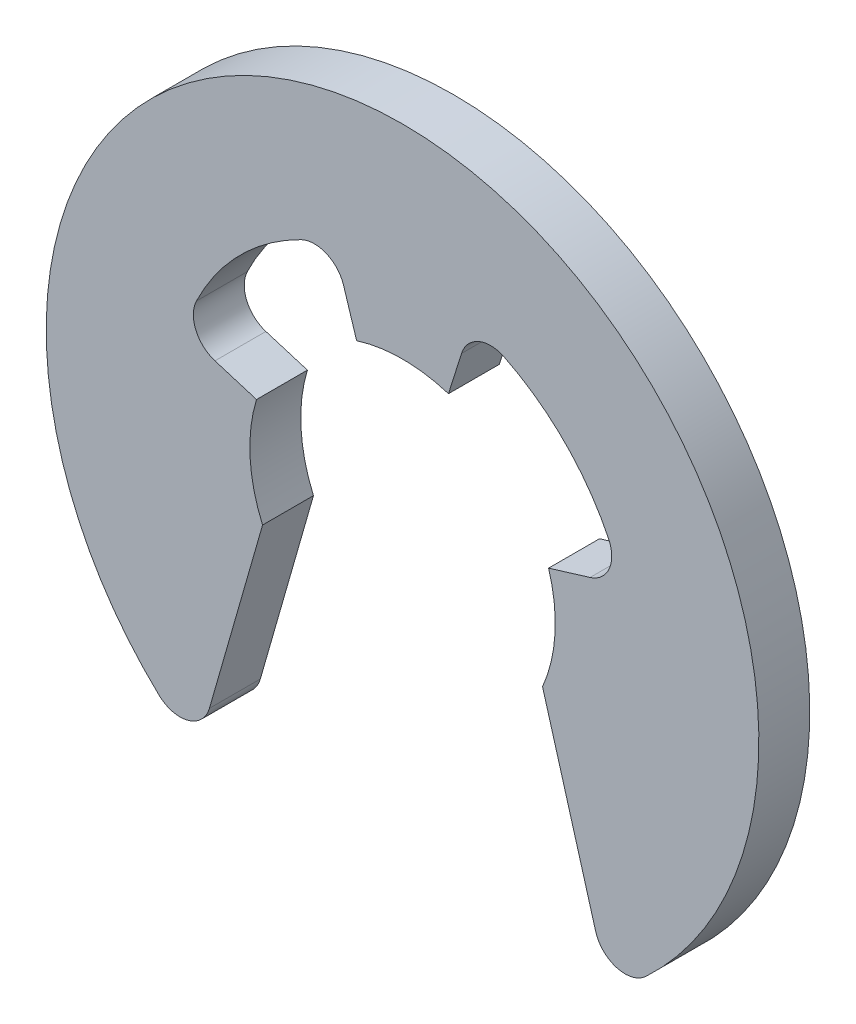
ISO-10303-21;
HEADER;
FILE_DESCRIPTION(('STEP AP214'),'2;1');
FILE_NAME('part.step','',(''),(''),'','','');
FILE_SCHEMA(('AUTOMOTIVE_DESIGN { 1 0 10303 214 1 1 1 1 }'));
ENDSEC;
DATA;
#1=APPLICATION_CONTEXT('core data for automotive mechanical design processes');
#2=APPLICATION_PROTOCOL_DEFINITION('international standard','automotive_design',2000,#1);
#3=PRODUCT_CONTEXT('',#1,'mechanical');
#4=PRODUCT('Part','Part','',(#3));
#5=PRODUCT_RELATED_PRODUCT_CATEGORY('part','',(#4));
#6=PRODUCT_DEFINITION_FORMATION('','',#4);
#7=PRODUCT_DEFINITION_CONTEXT('part definition',#1,'design');
#8=PRODUCT_DEFINITION('design','',#6,#7);
#9=PRODUCT_DEFINITION_SHAPE('','',#8);
#10=(LENGTH_UNIT() NAMED_UNIT(*) SI_UNIT(.MILLI.,.METRE.));
#11=(NAMED_UNIT(*) PLANE_ANGLE_UNIT() SI_UNIT($,.RADIAN.));
#12=(NAMED_UNIT(*) SI_UNIT($,.STERADIAN.) SOLID_ANGLE_UNIT());
#13=UNCERTAINTY_MEASURE_WITH_UNIT(LENGTH_MEASURE(1.E-05),#10,'distance_accuracy_value','');
#14=(GEOMETRIC_REPRESENTATION_CONTEXT(3) GLOBAL_UNCERTAINTY_ASSIGNED_CONTEXT((#13)) GLOBAL_UNIT_ASSIGNED_CONTEXT((#10,
#11,#12)) REPRESENTATION_CONTEXT('',''));
#15=CARTESIAN_POINT('',(0.,0.,0.));
#16=DIRECTION('',(0.,0.,1.));
#17=DIRECTION('',(1.,0.,0.));
#18=AXIS2_PLACEMENT_3D('',#15,#16,#17);
#19=CARTESIAN_POINT('',(0.,0.,1.));
#20=DIRECTION('',(0.,0.,-1.));
#21=DIRECTION('',(-1.,0.,0.));
#22=AXIS2_PLACEMENT_3D('',#19,#20,#21);
#23=CYLINDRICAL_SURFACE('',#22,4.5);
#24=CARTESIAN_POINT('',(0.,0.,0.));
#25=DIRECTION('',(0.,0.,1.));
#26=DIRECTION('',(1.,0.,0.));
#27=AXIS2_PLACEMENT_3D('',#24,#25,#26);
#28=CIRCLE('',#27,4.5);
#29=CARTESIAN_POINT('',(4.04972778357115,1.96206648179208,0.));
#30=VERTEX_POINT('',#29);
#31=CARTESIAN_POINT('',(1.99733186557464,4.03245153954268,0.));
#32=VERTEX_POINT('',#31);
#33=EDGE_CURVE('E207',#30,#32,#28,.T.);
#34=ORIENTED_EDGE('',*,*,#33,.F.);
#35=DIRECTION('',(0.,0.,-1.));
#36=VECTOR('',#35,1.);
#37=CARTESIAN_POINT('',(4.04972778357115,1.96206648179208,1.));
#38=LINE('',#37,#36);
#39=CARTESIAN_POINT('',(4.04972778357115,1.96206648179208,1.));
#40=VERTEX_POINT('',#39);
#41=EDGE_CURVE('E11',#40,#30,#38,.T.);
#42=ORIENTED_EDGE('',*,*,#41,.F.);
#43=CARTESIAN_POINT('',(0.,0.,1.));
#44=DIRECTION('',(0.,0.,1.));
#45=DIRECTION('',(1.,0.,0.));
#46=AXIS2_PLACEMENT_3D('',#43,#44,#45);
#47=CIRCLE('',#46,4.5);
#48=CARTESIAN_POINT('',(1.99733186557464,4.03245153954268,1.));
#49=VERTEX_POINT('',#48);
#50=EDGE_CURVE('E275',#40,#49,#47,.T.);
#51=ORIENTED_EDGE('',*,*,#50,.T.);
#52=DIRECTION('',(0.,0.,-1.));
#53=VECTOR('',#52,1.);
#54=CARTESIAN_POINT('',(1.99733186557464,4.03245153954268,1.));
#55=LINE('',#54,#53);
#56=EDGE_CURVE('E62',#49,#32,#55,.T.);
#57=ORIENTED_EDGE('',*,*,#56,.T.);
#58=EDGE_LOOP('',(#34,#42,#51,#57));
#59=FACE_BOUND('',#58,.T.);
#60=ADVANCED_FACE('F45',(#59),#23,.F.);
#61=CARTESIAN_POINT('',(3.50976407909499,1.70045761755313,1.));
#62=DIRECTION('',(0.,0.,-1.));
#63=DIRECTION('',(-1.,0.,0.));
#64=AXIS2_PLACEMENT_3D('',#61,#62,#63);
#65=CYLINDRICAL_SURFACE('',#64,0.6);
#66=CARTESIAN_POINT('',(3.50976407909499,1.70045761755313,0.));
#67=DIRECTION('',(0.,0.,1.));
#68=DIRECTION('',(1.,0.,0.));
#69=AXIS2_PLACEMENT_3D('',#66,#67,#68);
#70=CIRCLE('',#69,0.6);
#71=CARTESIAN_POINT('',(3.68518710192864,1.12667476397531,0.));
#72=VERTEX_POINT('',#71);
#73=EDGE_CURVE('E210',#30,#72,#70,.F.);
#74=ORIENTED_EDGE('',*,*,#73,.T.);
#75=DIRECTION('',(0.,0.,-1.));
#76=VECTOR('',#75,1.);
#77=CARTESIAN_POINT('',(3.68518710192864,1.12667476397531,1.));
#78=LINE('',#77,#76);
#79=CARTESIAN_POINT('',(3.68518710192864,1.12667476397531,1.));
#80=VERTEX_POINT('',#79);
#81=EDGE_CURVE('E54',#80,#72,#78,.T.);
#82=ORIENTED_EDGE('',*,*,#81,.F.);
#83=CARTESIAN_POINT('',(3.50976407909499,1.70045761755313,1.));
#84=DIRECTION('',(0.,0.,1.));
#85=DIRECTION('',(1.,0.,0.));
#86=AXIS2_PLACEMENT_3D('',#83,#84,#85);
#87=CIRCLE('',#86,0.6);
#88=EDGE_CURVE('E338',#40,#80,#87,.F.);
#89=ORIENTED_EDGE('',*,*,#88,.F.);
#90=ORIENTED_EDGE('',*,*,#41,.T.);
#91=EDGE_LOOP('',(#74,#82,#89,#90));
#92=FACE_BOUND('',#91,.T.);
#93=ADVANCED_FACE('F327',(#92),#65,.F.);
#94=CARTESIAN_POINT('',(0.,0.,1.));
#95=DIRECTION('',(-0.292371704722738,0.956304755963035,0.));
#96=DIRECTION('',(-0.956304755963035,-0.292371704722738,0.));
#97=AXIS2_PLACEMENT_3D('',#94,#95,#96);
#98=PLANE('',#97);
#99=DIRECTION('',(0.956304755963035,0.292371704722738,0.));
#100=VECTOR('',#99,1.);
#101=CARTESIAN_POINT('',(0.,0.,0.));
#102=LINE('',#101,#100);
#103=CARTESIAN_POINT('',(2.86891426788911,0.877115114168214,0.));
#104=VERTEX_POINT('',#103);
#105=EDGE_CURVE('E214',#104,#72,#102,.T.);
#106=ORIENTED_EDGE('',*,*,#105,.F.);
#107=DIRECTION('',(0.,0.,-1.));
#108=VECTOR('',#107,1.);
#109=CARTESIAN_POINT('',(2.86891426788911,0.877115114168214,1.));
#110=LINE('',#109,#108);
#111=CARTESIAN_POINT('',(2.86891426788911,0.877115114168214,1.));
#112=VERTEX_POINT('',#111);
#113=EDGE_CURVE('E315',#112,#104,#110,.T.);
#114=ORIENTED_EDGE('',*,*,#113,.F.);
#115=DIRECTION('',(0.956304755963035,0.292371704722738,0.));
#116=VECTOR('',#115,1.);
#117=CARTESIAN_POINT('',(0.,0.,1.));
#118=LINE('',#117,#116);
#119=EDGE_CURVE('E324',#112,#80,#118,.T.);
#120=ORIENTED_EDGE('',*,*,#119,.T.);
#121=ORIENTED_EDGE('',*,*,#81,.T.);
#122=EDGE_LOOP('',(#106,#114,#120,#121));
#123=FACE_BOUND('',#122,.T.);
#124=ADVANCED_FACE('F322',(#123),#98,.T.);
#125=CARTESIAN_POINT('',(0.,0.,1.));
#126=DIRECTION('',(0.,0.,-1.));
#127=DIRECTION('',(-1.,0.,0.));
#128=AXIS2_PLACEMENT_3D('',#125,#126,#127);
#129=CYLINDRICAL_SURFACE('',#128,3.);
#130=CARTESIAN_POINT('',(0.,0.,0.));
#131=DIRECTION('',(0.,0.,1.));
#132=DIRECTION('',(1.,0.,0.));
#133=AXIS2_PLACEMENT_3D('',#130,#131,#132);
#134=CIRCLE('',#133,3.);
#135=CARTESIAN_POINT('',(2.75,-1.19895788082818,0.));
#136=VERTEX_POINT('',#135);
#137=EDGE_CURVE('E218',#136,#104,#134,.T.);
#138=ORIENTED_EDGE('',*,*,#137,.F.);
#139=DIRECTION('',(0.,0.,-1.));
#140=VECTOR('',#139,1.);
#141=CARTESIAN_POINT('',(2.75,-1.19895788082818,1.));
#142=LINE('',#141,#140);
#143=CARTESIAN_POINT('',(2.75,-1.19895788082818,1.));
#144=VERTEX_POINT('',#143);
#145=EDGE_CURVE('E312',#144,#136,#142,.T.);
#146=ORIENTED_EDGE('',*,*,#145,.F.);
#147=CARTESIAN_POINT('',(0.,0.,1.));
#148=DIRECTION('',(0.,0.,1.));
#149=DIRECTION('',(1.,0.,0.));
#150=AXIS2_PLACEMENT_3D('',#147,#148,#149);
#151=CIRCLE('',#150,3.);
#152=EDGE_CURVE('E337',#144,#112,#151,.T.);
#153=ORIENTED_EDGE('',*,*,#152,.T.);
#154=ORIENTED_EDGE('',*,*,#113,.T.);
#155=EDGE_LOOP('',(#138,#146,#153,#154));
#156=FACE_BOUND('',#155,.T.);
#157=ADVANCED_FACE('F333',(#156),#129,.F.);
#158=CARTESIAN_POINT('',(2.22339069318757,0.637547022010596,1.));
#159=DIRECTION('',(0.961261695938321,0.275637355816993,0.));
#160=DIRECTION('',(-0.275637355816993,0.961261695938321,0.));
#161=AXIS2_PLACEMENT_3D('',#158,#159,#160);
#162=PLANE('',#161);
#163=DIRECTION('',(0.275637355816993,-0.961261695938321,0.));
#164=VECTOR('',#163,1.);
#165=CARTESIAN_POINT('',(2.22339069318757,0.637547022010596,0.));
#166=LINE('',#165,#164);
#167=CARTESIAN_POINT('',(3.79414825319568,-4.84033558053413,0.));
#168=VERTEX_POINT('',#167);
#169=EDGE_CURVE('E222',#136,#168,#166,.T.);
#170=ORIENTED_EDGE('',*,*,#169,.T.);
#171=DIRECTION('',(0.,0.,-1.));
#172=VECTOR('',#171,1.);
#173=CARTESIAN_POINT('',(3.79414825319568,-4.84033558053413,1.));
#174=LINE('',#173,#172);
#175=CARTESIAN_POINT('',(3.79414825319568,-4.84033558053413,1.));
#176=VERTEX_POINT('',#175);
#177=EDGE_CURVE('E309',#176,#168,#174,.T.);
#178=ORIENTED_EDGE('',*,*,#177,.F.);
#179=DIRECTION('',(0.275637355816993,-0.961261695938321,0.));
#180=VECTOR('',#179,1.);
#181=CARTESIAN_POINT('',(2.22339069318757,0.637547022010596,1.));
#182=LINE('',#181,#180);
#183=EDGE_CURVE('E343',#144,#176,#182,.T.);
#184=ORIENTED_EDGE('',*,*,#183,.F.);
#185=ORIENTED_EDGE('',*,*,#145,.T.);
#186=EDGE_LOOP('',(#170,#178,#184,#185));
#187=FACE_BOUND('',#186,.T.);
#188=ADVANCED_FACE('F411',(#187),#162,.F.);
#189=CARTESIAN_POINT('',(4.37090527075867,-4.67495316704393,1.));
#190=DIRECTION('',(0.,0.,-1.));
#191=DIRECTION('',(-1.,0.,0.));
#192=AXIS2_PLACEMENT_3D('',#189,#190,#191);
#193=CYLINDRICAL_SURFACE('',#192,0.600000000000001);
#194=CARTESIAN_POINT('',(4.37090527075867,-4.67495316704393,0.));
#195=DIRECTION('',(0.,0.,1.));
#196=DIRECTION('',(1.,0.,0.));
#197=AXIS2_PLACEMENT_3D('',#194,#195,#196);
#198=CIRCLE('',#197,0.600000000000001);
#199=CARTESIAN_POINT('',(4.78067763989229,-5.1132300264543,0.));
#200=VERTEX_POINT('',#199);
#201=EDGE_CURVE('E226',#200,#168,#198,.F.);
#202=ORIENTED_EDGE('',*,*,#201,.F.);
#203=DIRECTION('',(0.,0.,-1.));
#204=VECTOR('',#203,1.);
#205=CARTESIAN_POINT('',(4.78067763989229,-5.1132300264543,1.));
#206=LINE('',#205,#204);
#207=CARTESIAN_POINT('',(4.78067763989229,-5.1132300264543,1.));
#208=VERTEX_POINT('',#207);
#209=EDGE_CURVE('E306',#208,#200,#206,.T.);
#210=ORIENTED_EDGE('',*,*,#209,.F.);
#211=CARTESIAN_POINT('',(4.37090527075867,-4.67495316704393,1.));
#212=DIRECTION('',(0.,0.,1.));
#213=DIRECTION('',(1.,0.,0.));
#214=AXIS2_PLACEMENT_3D('',#211,#212,#213);
#215=CIRCLE('',#214,0.600000000000001);
#216=EDGE_CURVE('E350',#208,#176,#215,.F.);
#217=ORIENTED_EDGE('',*,*,#216,.T.);
#218=ORIENTED_EDGE('',*,*,#177,.T.);
#219=EDGE_LOOP('',(#202,#210,#217,#218));
#220=FACE_BOUND('',#219,.T.);
#221=ADVANCED_FACE('F414',(#220),#193,.T.);
#222=CARTESIAN_POINT('',(0.,0.,1.));
#223=DIRECTION('',(0.,0.,-1.));
#224=DIRECTION('',(-1.,0.,0.));
#225=AXIS2_PLACEMENT_3D('',#222,#223,#224);
#226=CYLINDRICAL_SURFACE('',#225,7.);
#227=CARTESIAN_POINT('',(0.,0.,0.));
#228=DIRECTION('',(0.,0.,1.));
#229=DIRECTION('',(1.,0.,0.));
#230=AXIS2_PLACEMENT_3D('',#227,#228,#229);
#231=CIRCLE('',#230,7.);
#232=CARTESIAN_POINT('',(-4.7806776398923,-5.1132300264543,0.));
#233=VERTEX_POINT('',#232);
#234=EDGE_CURVE('E230',#200,#233,#231,.T.);
#235=ORIENTED_EDGE('',*,*,#234,.T.);
#236=DIRECTION('',(0.,0.,-1.));
#237=VECTOR('',#236,1.);
#238=CARTESIAN_POINT('',(-4.7806776398923,-5.1132300264543,1.));
#239=LINE('',#238,#237);
#240=CARTESIAN_POINT('',(-4.7806776398923,-5.1132300264543,1.));
#241=VERTEX_POINT('',#240);
#242=EDGE_CURVE('E303',#241,#233,#239,.T.);
#243=ORIENTED_EDGE('',*,*,#242,.F.);
#244=CARTESIAN_POINT('',(0.,0.,1.));
#245=DIRECTION('',(0.,0.,1.));
#246=DIRECTION('',(1.,0.,0.));
#247=AXIS2_PLACEMENT_3D('',#244,#245,#246);
#248=CIRCLE('',#247,7.);
#249=EDGE_CURVE('E354',#208,#241,#248,.T.);
#250=ORIENTED_EDGE('',*,*,#249,.F.);
#251=ORIENTED_EDGE('',*,*,#209,.T.);
#252=EDGE_LOOP('',(#235,#243,#250,#251));
#253=FACE_BOUND('',#252,.T.);
#254=ADVANCED_FACE('F418',(#253),#226,.T.);
#255=CARTESIAN_POINT('',(-4.37090527075867,-4.67495316704393,1.));
#256=DIRECTION('',(0.,0.,-1.));
#257=DIRECTION('',(-1.,0.,0.));
#258=AXIS2_PLACEMENT_3D('',#255,#256,#257);
#259=CYLINDRICAL_SURFACE('',#258,0.600000000000001);
#260=CARTESIAN_POINT('',(-4.37090527075867,-4.67495316704393,0.));
#261=DIRECTION('',(0.,0.,1.));
#262=DIRECTION('',(1.,0.,0.));
#263=AXIS2_PLACEMENT_3D('',#260,#261,#262);
#264=CIRCLE('',#263,0.600000000000001);
#265=CARTESIAN_POINT('',(-3.79414825319568,-4.84033558053413,0.));
#266=VERTEX_POINT('',#265);
#267=EDGE_CURVE('E234',#266,#233,#264,.F.);
#268=ORIENTED_EDGE('',*,*,#267,.F.);
#269=DIRECTION('',(0.,0.,-1.));
#270=VECTOR('',#269,1.);
#271=CARTESIAN_POINT('',(-3.79414825319568,-4.84033558053413,1.));
#272=LINE('',#271,#270);
#273=CARTESIAN_POINT('',(-3.79414825319568,-4.84033558053413,1.));
#274=VERTEX_POINT('',#273);
#275=EDGE_CURVE('E300',#274,#266,#272,.T.);
#276=ORIENTED_EDGE('',*,*,#275,.F.);
#277=CARTESIAN_POINT('',(-4.37090527075867,-4.67495316704393,1.));
#278=DIRECTION('',(0.,0.,1.));
#279=DIRECTION('',(1.,0.,0.));
#280=AXIS2_PLACEMENT_3D('',#277,#278,#279);
#281=CIRCLE('',#280,0.600000000000001);
#282=EDGE_CURVE('E357',#274,#241,#281,.F.);
#283=ORIENTED_EDGE('',*,*,#282,.T.);
#284=ORIENTED_EDGE('',*,*,#242,.T.);
#285=EDGE_LOOP('',(#268,#276,#283,#284));
#286=FACE_BOUND('',#285,.T.);
#287=ADVANCED_FACE('F422',(#286),#259,.T.);
#288=CARTESIAN_POINT('',(-2.22339069318757,0.637547022010596,1.));
#289=DIRECTION('',(0.961261695938321,-0.275637355816993,0.));
#290=DIRECTION('',(0.275637355816993,0.961261695938321,0.));
#291=AXIS2_PLACEMENT_3D('',#288,#289,#290);
#292=PLANE('',#291);
#293=DIRECTION('',(-0.275637355816993,-0.961261695938321,0.));
#294=VECTOR('',#293,1.);
#295=CARTESIAN_POINT('',(-2.22339069318757,0.637547022010596,0.));
#296=LINE('',#295,#294);
#297=CARTESIAN_POINT('',(-2.75,-1.19895788082818,0.));
#298=VERTEX_POINT('',#297);
#299=EDGE_CURVE('E238',#298,#266,#296,.T.);
#300=ORIENTED_EDGE('',*,*,#299,.F.);
#301=DIRECTION('',(0.,0.,-1.));
#302=VECTOR('',#301,1.);
#303=CARTESIAN_POINT('',(-2.75,-1.19895788082818,1.));
#304=LINE('',#303,#302);
#305=CARTESIAN_POINT('',(-2.75,-1.19895788082818,1.));
#306=VERTEX_POINT('',#305);
#307=EDGE_CURVE('E297',#306,#298,#304,.T.);
#308=ORIENTED_EDGE('',*,*,#307,.F.);
#309=DIRECTION('',(-0.275637355816993,-0.961261695938321,0.));
#310=VECTOR('',#309,1.);
#311=CARTESIAN_POINT('',(-2.22339069318757,0.637547022010596,1.));
#312=LINE('',#311,#310);
#313=EDGE_CURVE('E361',#306,#274,#312,.T.);
#314=ORIENTED_EDGE('',*,*,#313,.T.);
#315=ORIENTED_EDGE('',*,*,#275,.T.);
#316=EDGE_LOOP('',(#300,#308,#314,#315));
#317=FACE_BOUND('',#316,.T.);
#318=ADVANCED_FACE('F426',(#317),#292,.T.);
#319=CARTESIAN_POINT('',(0.,0.,1.));
#320=DIRECTION('',(0.,0.,-1.));
#321=DIRECTION('',(-1.,0.,0.));
#322=AXIS2_PLACEMENT_3D('',#319,#320,#321);
#323=CYLINDRICAL_SURFACE('',#322,3.);
#324=CARTESIAN_POINT('',(0.,0.,0.));
#325=DIRECTION('',(0.,0.,1.));
#326=DIRECTION('',(1.,0.,0.));
#327=AXIS2_PLACEMENT_3D('',#324,#325,#326);
#328=CIRCLE('',#327,3.);
#329=CARTESIAN_POINT('',(-2.86891426788911,0.877115114168192,0.));
#330=VERTEX_POINT('',#329);
#331=EDGE_CURVE('E242',#330,#298,#328,.T.);
#332=ORIENTED_EDGE('',*,*,#331,.F.);
#333=DIRECTION('',(0.,0.,-1.));
#334=VECTOR('',#333,1.);
#335=CARTESIAN_POINT('',(-2.86891426788911,0.877115114168192,1.));
#336=LINE('',#335,#334);
#337=CARTESIAN_POINT('',(-2.86891426788911,0.877115114168192,1.));
#338=VERTEX_POINT('',#337);
#339=EDGE_CURVE('E294',#338,#330,#336,.T.);
#340=ORIENTED_EDGE('',*,*,#339,.F.);
#341=CARTESIAN_POINT('',(0.,0.,1.));
#342=DIRECTION('',(0.,0.,1.));
#343=DIRECTION('',(1.,0.,0.));
#344=AXIS2_PLACEMENT_3D('',#341,#342,#343);
#345=CIRCLE('',#344,3.);
#346=EDGE_CURVE('E365',#338,#306,#345,.T.);
#347=ORIENTED_EDGE('',*,*,#346,.T.);
#348=ORIENTED_EDGE('',*,*,#307,.T.);
#349=EDGE_LOOP('',(#332,#340,#347,#348));
#350=FACE_BOUND('',#349,.T.);
#351=ADVANCED_FACE('F430',(#350),#323,.F.);
#352=CARTESIAN_POINT('',(0.,0.,1.));
#353=DIRECTION('',(-0.292371704722731,-0.956304755963037,0.));
#354=DIRECTION('',(0.956304755963037,-0.292371704722731,0.));
#355=AXIS2_PLACEMENT_3D('',#352,#353,#354);
#356=PLANE('',#355);
#357=DIRECTION('',(-0.956304755963037,0.292371704722731,0.));
#358=VECTOR('',#357,1.);
#359=CARTESIAN_POINT('',(0.,0.,0.));
#360=LINE('',#359,#358);
#361=CARTESIAN_POINT('',(-3.68518710192864,1.12667476397529,0.));
#362=VERTEX_POINT('',#361);
#363=EDGE_CURVE('E246',#330,#362,#360,.T.);
#364=ORIENTED_EDGE('',*,*,#363,.T.);
#365=DIRECTION('',(0.,0.,-1.));
#366=VECTOR('',#365,1.);
#367=CARTESIAN_POINT('',(-3.68518710192864,1.12667476397529,1.));
#368=LINE('',#367,#366);
#369=CARTESIAN_POINT('',(-3.68518710192864,1.12667476397529,1.));
#370=VERTEX_POINT('',#369);
#371=EDGE_CURVE('E291',#370,#362,#368,.T.);
#372=ORIENTED_EDGE('',*,*,#371,.F.);
#373=DIRECTION('',(-0.956304755963037,0.292371704722731,0.));
#374=VECTOR('',#373,1.);
#375=CARTESIAN_POINT('',(0.,0.,1.));
#376=LINE('',#375,#374);
#377=EDGE_CURVE('E369',#338,#370,#376,.T.);
#378=ORIENTED_EDGE('',*,*,#377,.F.);
#379=ORIENTED_EDGE('',*,*,#339,.T.);
#380=EDGE_LOOP('',(#364,#372,#378,#379));
#381=FACE_BOUND('',#380,.T.);
#382=ADVANCED_FACE('F434',(#381),#356,.F.);
#383=CARTESIAN_POINT('',(-3.509764079095,1.70045761755311,1.));
#384=DIRECTION('',(0.,0.,-1.));
#385=DIRECTION('',(-1.,0.,0.));
#386=AXIS2_PLACEMENT_3D('',#383,#384,#385);
#387=CYLINDRICAL_SURFACE('',#386,0.6);
#388=CARTESIAN_POINT('',(-3.509764079095,1.70045761755311,0.));
#389=DIRECTION('',(0.,0.,1.));
#390=DIRECTION('',(1.,0.,0.));
#391=AXIS2_PLACEMENT_3D('',#388,#389,#390);
#392=CIRCLE('',#391,0.6);
#393=CARTESIAN_POINT('',(-4.04972778357116,1.96206648179205,0.));
#394=VERTEX_POINT('',#393);
#395=EDGE_CURVE('E250',#394,#362,#392,.T.);
#396=ORIENTED_EDGE('',*,*,#395,.F.);
#397=DIRECTION('',(0.,0.,-1.));
#398=VECTOR('',#397,1.);
#399=CARTESIAN_POINT('',(-4.04972778357116,1.96206648179205,1.));
#400=LINE('',#399,#398);
#401=CARTESIAN_POINT('',(-4.04972778357116,1.96206648179205,1.));
#402=VERTEX_POINT('',#401);
#403=EDGE_CURVE('E288',#402,#394,#400,.T.);
#404=ORIENTED_EDGE('',*,*,#403,.F.);
#405=CARTESIAN_POINT('',(-3.509764079095,1.70045761755311,1.));
#406=DIRECTION('',(0.,0.,1.));
#407=DIRECTION('',(1.,0.,0.));
#408=AXIS2_PLACEMENT_3D('',#405,#406,#407);
#409=CIRCLE('',#408,0.6);
#410=EDGE_CURVE('E372',#402,#370,#409,.T.);
#411=ORIENTED_EDGE('',*,*,#410,.T.);
#412=ORIENTED_EDGE('',*,*,#371,.T.);
#413=EDGE_LOOP('',(#396,#404,#411,#412));
#414=FACE_BOUND('',#413,.T.);
#415=ADVANCED_FACE('F438',(#414),#387,.F.);
#416=CARTESIAN_POINT('',(0.,0.,1.));
#417=DIRECTION('',(0.,0.,-1.));
#418=DIRECTION('',(-1.,0.,0.));
#419=AXIS2_PLACEMENT_3D('',#416,#417,#418);
#420=CYLINDRICAL_SURFACE('',#419,4.5);
#421=CARTESIAN_POINT('',(0.,0.,0.));
#422=DIRECTION('',(0.,0.,1.));
#423=DIRECTION('',(1.,0.,0.));
#424=AXIS2_PLACEMENT_3D('',#421,#422,#423);
#425=CIRCLE('',#424,4.5);
#426=CARTESIAN_POINT('',(-1.99733186557464,4.03245153954268,0.));
#427=VERTEX_POINT('',#426);
#428=EDGE_CURVE('E254',#427,#394,#425,.T.);
#429=ORIENTED_EDGE('',*,*,#428,.F.);
#430=DIRECTION('',(0.,0.,-1.));
#431=VECTOR('',#430,1.);
#432=CARTESIAN_POINT('',(-1.99733186557464,4.03245153954268,1.));
#433=LINE('',#432,#431);
#434=CARTESIAN_POINT('',(-1.99733186557464,4.03245153954268,1.));
#435=VERTEX_POINT('',#434);
#436=EDGE_CURVE('E285',#435,#427,#433,.T.);
#437=ORIENTED_EDGE('',*,*,#436,.F.);
#438=CARTESIAN_POINT('',(0.,0.,1.));
#439=DIRECTION('',(0.,0.,1.));
#440=DIRECTION('',(1.,0.,0.));
#441=AXIS2_PLACEMENT_3D('',#438,#439,#440);
#442=CIRCLE('',#441,4.5);
#443=EDGE_CURVE('E376',#435,#402,#442,.T.);
#444=ORIENTED_EDGE('',*,*,#443,.T.);
#445=ORIENTED_EDGE('',*,*,#403,.T.);
#446=EDGE_LOOP('',(#429,#437,#444,#445));
#447=FACE_BOUND('',#446,.T.);
#448=ADVANCED_FACE('F442',(#447),#420,.F.);
#449=CARTESIAN_POINT('',(-1.73102095016469,3.49479133427032,1.));
#450=DIRECTION('',(0.,0.,-1.));
#451=DIRECTION('',(-1.,0.,0.));
#452=AXIS2_PLACEMENT_3D('',#449,#450,#451);
#453=CYLINDRICAL_SURFACE('',#452,0.600000000000001);
#454=CARTESIAN_POINT('',(-1.73102095016469,3.49479133427032,0.));
#455=DIRECTION('',(0.,0.,1.));
#456=DIRECTION('',(1.,0.,0.));
#457=AXIS2_PLACEMENT_3D('',#454,#455,#456);
#458=CIRCLE('',#457,0.600000000000001);
#459=CARTESIAN_POINT('',(-1.15879077971575,3.67521481397289,0.));
#460=VERTEX_POINT('',#459);
#461=EDGE_CURVE('E258',#460,#427,#458,.T.);
#462=ORIENTED_EDGE('',*,*,#461,.F.);
#463=DIRECTION('',(0.,0.,-1.));
#464=VECTOR('',#463,1.);
#465=CARTESIAN_POINT('',(-1.15879077971575,3.67521481397289,1.));
#466=LINE('',#465,#464);
#467=CARTESIAN_POINT('',(-1.15879077971575,3.67521481397289,1.));
#468=VERTEX_POINT('',#467);
#469=EDGE_CURVE('E282',#468,#460,#466,.T.);
#470=ORIENTED_EDGE('',*,*,#469,.F.);
#471=CARTESIAN_POINT('',(-1.73102095016469,3.49479133427032,1.));
#472=DIRECTION('',(0.,0.,1.));
#473=DIRECTION('',(1.,0.,0.));
#474=AXIS2_PLACEMENT_3D('',#471,#472,#473);
#475=CIRCLE('',#474,0.600000000000001);
#476=EDGE_CURVE('E201',#468,#435,#475,.T.);
#477=ORIENTED_EDGE('',*,*,#476,.T.);
#478=ORIENTED_EDGE('',*,*,#436,.T.);
#479=EDGE_LOOP('',(#462,#470,#477,#478));
#480=FACE_BOUND('',#479,.T.);
#481=ADVANCED_FACE('F383',(#480),#453,.F.);
#482=CARTESIAN_POINT('',(0.,0.,1.));
#483=DIRECTION('',(-0.953716950748227,-0.300705799504273,0.));
#484=DIRECTION('',(0.300705799504273,-0.953716950748227,0.));
#485=AXIS2_PLACEMENT_3D('',#482,#483,#484);
#486=PLANE('',#485);
#487=DIRECTION('',(-0.300705799504273,0.953716950748227,0.));
#488=VECTOR('',#487,1.);
#489=CARTESIAN_POINT('',(0.,0.,0.));
#490=LINE('',#489,#488);
#491=CARTESIAN_POINT('',(-0.902117398512821,2.86115085224468,0.));
#492=VERTEX_POINT('',#491);
#493=EDGE_CURVE('E262',#492,#460,#490,.T.);
#494=ORIENTED_EDGE('',*,*,#493,.F.);
#495=DIRECTION('',(0.,0.,-1.));
#496=VECTOR('',#495,1.);
#497=CARTESIAN_POINT('',(-0.902117398512821,2.86115085224468,1.));
#498=LINE('',#497,#496);
#499=CARTESIAN_POINT('',(-0.902117398512821,2.86115085224468,1.));
#500=VERTEX_POINT('',#499);
#501=EDGE_CURVE('E183',#500,#492,#498,.T.);
#502=ORIENTED_EDGE('',*,*,#501,.F.);
#503=DIRECTION('',(-0.300705799504273,0.953716950748227,0.));
#504=VECTOR('',#503,1.);
#505=CARTESIAN_POINT('',(0.,0.,1.));
#506=LINE('',#505,#504);
#507=EDGE_CURVE('E197',#500,#468,#506,.T.);
#508=ORIENTED_EDGE('',*,*,#507,.T.);
#509=ORIENTED_EDGE('',*,*,#469,.T.);
#510=EDGE_LOOP('',(#494,#502,#508,#509));
#511=FACE_BOUND('',#510,.T.);
#512=ADVANCED_FACE('F389',(#511),#486,.T.);
#513=CARTESIAN_POINT('',(0.,0.,1.));
#514=DIRECTION('',(0.,0.,-1.));
#515=DIRECTION('',(-1.,0.,0.));
#516=AXIS2_PLACEMENT_3D('',#513,#514,#515);
#517=CYLINDRICAL_SURFACE('',#516,3.);
#518=CARTESIAN_POINT('',(0.,0.,0.));
#519=DIRECTION('',(0.,0.,1.));
#520=DIRECTION('',(1.,0.,0.));
#521=AXIS2_PLACEMENT_3D('',#518,#519,#520);
#522=CIRCLE('',#521,3.);
#523=CARTESIAN_POINT('',(0.902117398512821,2.86115085224468,0.));
#524=VERTEX_POINT('',#523);
#525=EDGE_CURVE('E179',#524,#492,#522,.T.);
#526=ORIENTED_EDGE('',*,*,#525,.F.);
#527=DIRECTION('',(0.,0.,-1.));
#528=VECTOR('',#527,1.);
#529=CARTESIAN_POINT('',(0.902117398512821,2.86115085224468,1.));
#530=LINE('',#529,#528);
#531=CARTESIAN_POINT('',(0.902117398512821,2.86115085224468,1.));
#532=VERTEX_POINT('',#531);
#533=EDGE_CURVE('E173',#532,#524,#530,.T.);
#534=ORIENTED_EDGE('',*,*,#533,.F.);
#535=CARTESIAN_POINT('',(0.,0.,1.));
#536=DIRECTION('',(0.,0.,1.));
#537=DIRECTION('',(1.,0.,0.));
#538=AXIS2_PLACEMENT_3D('',#535,#536,#537);
#539=CIRCLE('',#538,3.);
#540=EDGE_CURVE('E177',#532,#500,#539,.T.);
#541=ORIENTED_EDGE('',*,*,#540,.T.);
#542=ORIENTED_EDGE('',*,*,#501,.T.);
#543=EDGE_LOOP('',(#526,#534,#541,#542));
#544=FACE_BOUND('',#543,.T.);
#545=ADVANCED_FACE('F175',(#544),#517,.F.);
#546=CARTESIAN_POINT('',(0.,0.,1.));
#547=DIRECTION('',(-0.953716950748227,0.300705799504274,0.));
#548=DIRECTION('',(-0.300705799504274,-0.953716950748227,0.));
#549=AXIS2_PLACEMENT_3D('',#546,#547,#548);
#550=PLANE('',#549);
#551=DIRECTION('',(0.300705799504274,0.953716950748227,0.));
#552=VECTOR('',#551,1.);
#553=CARTESIAN_POINT('',(0.,0.,0.));
#554=LINE('',#553,#552);
#555=CARTESIAN_POINT('',(1.15879077971575,3.67521481397289,0.));
#556=VERTEX_POINT('',#555);
#557=EDGE_CURVE('E268',#524,#556,#554,.T.);
#558=ORIENTED_EDGE('',*,*,#557,.T.);
#559=DIRECTION('',(0.,0.,-1.));
#560=VECTOR('',#559,1.);
#561=CARTESIAN_POINT('',(1.15879077971575,3.67521481397289,1.));
#562=LINE('',#561,#560);
#563=CARTESIAN_POINT('',(1.15879077971575,3.67521481397289,1.));
#564=VERTEX_POINT('',#563);
#565=EDGE_CURVE('E118',#564,#556,#562,.T.);
#566=ORIENTED_EDGE('',*,*,#565,.F.);
#567=DIRECTION('',(0.300705799504274,0.953716950748227,0.));
#568=VECTOR('',#567,1.);
#569=CARTESIAN_POINT('',(0.,0.,1.));
#570=LINE('',#569,#568);
#571=EDGE_CURVE('E185',#532,#564,#570,.T.);
#572=ORIENTED_EDGE('',*,*,#571,.F.);
#573=ORIENTED_EDGE('',*,*,#533,.T.);
#574=EDGE_LOOP('',(#558,#566,#572,#573));
#575=FACE_BOUND('',#574,.T.);
#576=ADVANCED_FACE('F186',(#575),#550,.F.);
#577=CARTESIAN_POINT('',(1.73102095016469,3.49479133427032,1.));
#578=DIRECTION('',(0.,0.,-1.));
#579=DIRECTION('',(-1.,0.,0.));
#580=AXIS2_PLACEMENT_3D('',#577,#578,#579);
#581=CYLINDRICAL_SURFACE('',#580,0.600000000000001);
#582=CARTESIAN_POINT('',(1.73102095016469,3.49479133427032,0.));
#583=DIRECTION('',(0.,0.,1.));
#584=DIRECTION('',(1.,0.,0.));
#585=AXIS2_PLACEMENT_3D('',#582,#583,#584);
#586=CIRCLE('',#585,0.600000000000001);
#587=EDGE_CURVE('E271',#32,#556,#586,.T.);
#588=ORIENTED_EDGE('',*,*,#587,.F.);
#589=ORIENTED_EDGE('',*,*,#56,.F.);
#590=CARTESIAN_POINT('',(1.73102095016469,3.49479133427032,1.));
#591=DIRECTION('',(0.,0.,1.));
#592=DIRECTION('',(1.,0.,0.));
#593=AXIS2_PLACEMENT_3D('',#590,#591,#592);
#594=CIRCLE('',#593,0.600000000000001);
#595=EDGE_CURVE('E190',#49,#564,#594,.T.);
#596=ORIENTED_EDGE('',*,*,#595,.T.);
#597=ORIENTED_EDGE('',*,*,#565,.T.);
#598=EDGE_LOOP('',(#588,#589,#596,#597));
#599=FACE_BOUND('',#598,.T.);
#600=ADVANCED_FACE('F390',(#599),#581,.F.);
#601=CARTESIAN_POINT('',(0.,0.,1.));
#602=DIRECTION('',(0.,0.,1.));
#603=DIRECTION('',(1.,0.,0.));
#604=AXIS2_PLACEMENT_3D('',#601,#602,#603);
#605=PLANE('',#604);
#606=ORIENTED_EDGE('',*,*,#50,.F.);
#607=ORIENTED_EDGE('',*,*,#88,.T.);
#608=ORIENTED_EDGE('',*,*,#119,.F.);
#609=ORIENTED_EDGE('',*,*,#152,.F.);
#610=ORIENTED_EDGE('',*,*,#183,.T.);
#611=ORIENTED_EDGE('',*,*,#216,.F.);
#612=ORIENTED_EDGE('',*,*,#249,.T.);
#613=ORIENTED_EDGE('',*,*,#282,.F.);
#614=ORIENTED_EDGE('',*,*,#313,.F.);
#615=ORIENTED_EDGE('',*,*,#346,.F.);
#616=ORIENTED_EDGE('',*,*,#377,.T.);
#617=ORIENTED_EDGE('',*,*,#410,.F.);
#618=ORIENTED_EDGE('',*,*,#443,.F.);
#619=ORIENTED_EDGE('',*,*,#476,.F.);
#620=ORIENTED_EDGE('',*,*,#507,.F.);
#621=ORIENTED_EDGE('',*,*,#540,.F.);
#622=ORIENTED_EDGE('',*,*,#571,.T.);
#623=ORIENTED_EDGE('',*,*,#595,.F.);
#624=EDGE_LOOP('',(#606,#607,#608,#609,#610,#611,#612,#613,#614,#615,#616,#617,#618,#619,#620,
#621,#622,#623));
#625=FACE_BOUND('',#624,.T.);
#626=ADVANCED_FACE('F194',(#625),#605,.T.);
#627=CARTESIAN_POINT('',(0.,0.,0.));
#628=DIRECTION('',(0.,0.,1.));
#629=DIRECTION('',(1.,0.,0.));
#630=AXIS2_PLACEMENT_3D('',#627,#628,#629);
#631=PLANE('',#630);
#632=ORIENTED_EDGE('',*,*,#33,.T.);
#633=ORIENTED_EDGE('',*,*,#587,.T.);
#634=ORIENTED_EDGE('',*,*,#557,.F.);
#635=ORIENTED_EDGE('',*,*,#525,.T.);
#636=ORIENTED_EDGE('',*,*,#493,.T.);
#637=ORIENTED_EDGE('',*,*,#461,.T.);
#638=ORIENTED_EDGE('',*,*,#428,.T.);
#639=ORIENTED_EDGE('',*,*,#395,.T.);
#640=ORIENTED_EDGE('',*,*,#363,.F.);
#641=ORIENTED_EDGE('',*,*,#331,.T.);
#642=ORIENTED_EDGE('',*,*,#299,.T.);
#643=ORIENTED_EDGE('',*,*,#267,.T.);
#644=ORIENTED_EDGE('',*,*,#234,.F.);
#645=ORIENTED_EDGE('',*,*,#201,.T.);
#646=ORIENTED_EDGE('',*,*,#169,.F.);
#647=ORIENTED_EDGE('',*,*,#137,.T.);
#648=ORIENTED_EDGE('',*,*,#105,.T.);
#649=ORIENTED_EDGE('',*,*,#73,.F.);
#650=EDGE_LOOP('',(#632,#633,#634,#635,#636,#637,#638,#639,#640,#641,#642,#643,#644,#645,#646,
#647,#648,#649));
#651=FACE_BOUND('',#650,.T.);
#652=ADVANCED_FACE('F329',(#651),#631,.F.);
#653=CLOSED_SHELL('',(#60,#93,#124,#157,#188,#221,#254,#287,#318,#351,#382,#415,#448,#481,#512,
#545,#576,#600,#626,#652));
#654=MANIFOLD_SOLID_BREP('B2',#653);
#655=ADVANCED_BREP_SHAPE_REPRESENTATION('',(#18,#654),#14);
#656=SHAPE_DEFINITION_REPRESENTATION(#9,#655);
ENDSEC;
END-ISO-10303-21;
